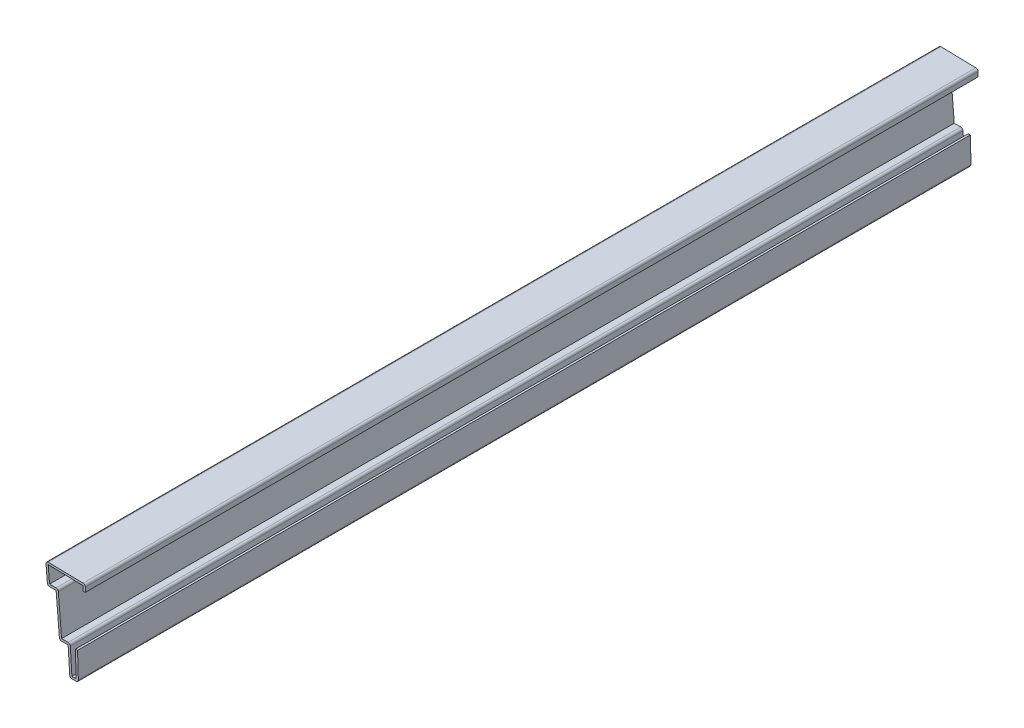
ISO-10303-21;
HEADER;
FILE_DESCRIPTION(('STEP AP214'),'2;1');
FILE_NAME('part.step','',(''),(''),'','','');
FILE_SCHEMA(('AUTOMOTIVE_DESIGN { 1 0 10303 214 1 1 1 1 }'));
ENDSEC;
DATA;
#1=APPLICATION_CONTEXT('core data for automotive mechanical design processes');
#2=APPLICATION_PROTOCOL_DEFINITION('international standard','automotive_design',2000,#1);
#3=PRODUCT_CONTEXT('',#1,'mechanical');
#4=PRODUCT('Part','Part','',(#3));
#5=PRODUCT_RELATED_PRODUCT_CATEGORY('part','',(#4));
#6=PRODUCT_DEFINITION_FORMATION('','',#4);
#7=PRODUCT_DEFINITION_CONTEXT('part definition',#1,'design');
#8=PRODUCT_DEFINITION('design','',#6,#7);
#9=PRODUCT_DEFINITION_SHAPE('','',#8);
#10=(LENGTH_UNIT() NAMED_UNIT(*) SI_UNIT(.MILLI.,.METRE.));
#11=(NAMED_UNIT(*) PLANE_ANGLE_UNIT() SI_UNIT($,.RADIAN.));
#12=(NAMED_UNIT(*) SI_UNIT($,.STERADIAN.) SOLID_ANGLE_UNIT());
#13=UNCERTAINTY_MEASURE_WITH_UNIT(LENGTH_MEASURE(1.E-05),#10,'distance_accuracy_value','');
#14=(GEOMETRIC_REPRESENTATION_CONTEXT(3) GLOBAL_UNCERTAINTY_ASSIGNED_CONTEXT((#13)) GLOBAL_UNIT_ASSIGNED_CONTEXT((#10,
#11,#12)) REPRESENTATION_CONTEXT('',''));
#15=CARTESIAN_POINT('',(0.,0.,0.));
#16=DIRECTION('',(0.,0.,1.));
#17=DIRECTION('',(1.,0.,0.));
#18=AXIS2_PLACEMENT_3D('',#15,#16,#17);
#19=CARTESIAN_POINT('',(2.15899999999999,40.878125,-412.75));
#20=DIRECTION('',(-1.,0.,0.));
#21=DIRECTION('',(0.,-1.,0.));
#22=AXIS2_PLACEMENT_3D('',#19,#20,#21);
#23=PLANE('',#22);
#24=DIRECTION('',(0.,-1.,0.));
#25=VECTOR('',#24,1.);
#26=CARTESIAN_POINT('',(2.15899999999999,40.878125,0.));
#27=LINE('',#26,#25);
#28=CARTESIAN_POINT('',(2.15899999999999,39.883971909265,0.));
#29=VERTEX_POINT('',#28);
#30=CARTESIAN_POINT('',(2.159,37.703125,0.));
#31=VERTEX_POINT('',#30);
#32=EDGE_CURVE('E295',#29,#31,#27,.T.);
#33=ORIENTED_EDGE('',*,*,#32,.F.);
#34=DIRECTION('',(0.,0.,1.));
#35=VECTOR('',#34,1.);
#36=CARTESIAN_POINT('',(2.15899999999999,39.883971909265,-412.75));
#37=LINE('',#36,#35);
#38=CARTESIAN_POINT('',(2.15899999999999,39.883971909265,-412.75));
#39=VERTEX_POINT('',#38);
#40=EDGE_CURVE('E245',#39,#29,#37,.T.);
#41=ORIENTED_EDGE('',*,*,#40,.F.);
#42=DIRECTION('',(0.,-1.,0.));
#43=VECTOR('',#42,1.);
#44=CARTESIAN_POINT('',(2.15899999999999,40.878125,-412.75));
#45=LINE('',#44,#43);
#46=CARTESIAN_POINT('',(2.159,37.703125,-412.75));
#47=VERTEX_POINT('',#46);
#48=EDGE_CURVE('E227',#39,#47,#45,.T.);
#49=ORIENTED_EDGE('',*,*,#48,.T.);
#50=DIRECTION('',(0.,0.,1.));
#51=VECTOR('',#50,1.);
#52=CARTESIAN_POINT('',(2.159,37.703125,-412.75));
#53=LINE('',#52,#51);
#54=EDGE_CURVE('E235',#47,#31,#53,.T.);
#55=ORIENTED_EDGE('',*,*,#54,.T.);
#56=EDGE_LOOP('',(#33,#41,#49,#55));
#57=FACE_BOUND('',#56,.T.);
#58=ADVANCED_FACE('F35',(#57),#23,.T.);
#59=CARTESIAN_POINT('',(-15.1033317393358,40.2592399905549,-412.75));
#60=DIRECTION('',(-0.0217339954092155,-0.999763788823916,0.));
#61=DIRECTION('',(0.999763788823916,-0.0217339954092155,0.));
#62=AXIS2_PLACEMENT_3D('',#59,#60,#61);
#63=PLANE('',#62);
#64=DIRECTION('',(0.999763788823916,-0.0217339954092155,0.));
#65=VECTOR('',#64,1.);
#66=CARTESIAN_POINT('',(-15.1033317393358,40.2592399905549,0.));
#67=LINE('',#66,#65);
#68=CARTESIAN_POINT('',(-13.975037647172,40.2347118581166,0.));
#69=VERTEX_POINT('',#68);
#70=EDGE_CURVE('E246',#69,#29,#67,.T.);
#71=ORIENTED_EDGE('',*,*,#70,.F.);
#72=DIRECTION('',(0.,0.,1.));
#73=VECTOR('',#72,1.);
#74=CARTESIAN_POINT('',(-13.975037647172,40.2347118581166,-412.75));
#75=LINE('',#74,#73);
#76=CARTESIAN_POINT('',(-13.975037647172,40.2347118581166,-412.75));
#77=VERTEX_POINT('',#76);
#78=EDGE_CURVE('E343',#77,#69,#75,.T.);
#79=ORIENTED_EDGE('',*,*,#78,.F.);
#80=DIRECTION('',(0.999763788823916,-0.0217339954092155,0.));
#81=VECTOR('',#80,1.);
#82=CARTESIAN_POINT('',(-15.1033317393358,40.2592399905549,-412.75));
#83=LINE('',#82,#81);
#84=EDGE_CURVE('E243',#77,#39,#83,.T.);
#85=ORIENTED_EDGE('',*,*,#84,.T.);
#86=ORIENTED_EDGE('',*,*,#40,.T.);
#87=EDGE_LOOP('',(#71,#79,#85,#86));
#88=FACE_BOUND('',#87,.T.);
#89=ADVANCED_FACE('F447',(#88),#63,.T.);
#90=CARTESIAN_POINT('',(-13.2750095096232,31.8343742075314,-412.75));
#91=DIRECTION('',(0.99654575824488,0.0830454798537397,0.));
#92=DIRECTION('',(-0.0830454798537397,0.99654575824488,0.));
#93=AXIS2_PLACEMENT_3D('',#90,#91,#92);
#94=PLANE('',#93);
#95=DIRECTION('',(-0.0830454798537397,0.99654575824488,0.));
#96=VECTOR('',#95,1.);
#97=CARTESIAN_POINT('',(-13.2750095096232,31.8343742075314,0.));
#98=LINE('',#97,#96);
#99=CARTESIAN_POINT('',(-13.3526449923289,32.766,0.));
#100=VERTEX_POINT('',#99);
#101=EDGE_CURVE('E249',#100,#69,#98,.T.);
#102=ORIENTED_EDGE('',*,*,#101,.F.);
#103=DIRECTION('',(0.,0.,1.));
#104=VECTOR('',#103,1.);
#105=CARTESIAN_POINT('',(-13.3526449923289,32.766,-412.75));
#106=LINE('',#105,#104);
#107=CARTESIAN_POINT('',(-13.3526449923289,32.766,-412.75));
#108=VERTEX_POINT('',#107);
#109=EDGE_CURVE('E345',#108,#100,#106,.T.);
#110=ORIENTED_EDGE('',*,*,#109,.F.);
#111=DIRECTION('',(-0.0830454798537397,0.99654575824488,0.));
#112=VECTOR('',#111,1.);
#113=CARTESIAN_POINT('',(-13.2750095096232,31.8343742075314,-412.75));
#114=LINE('',#113,#112);
#115=EDGE_CURVE('E291',#108,#77,#114,.T.);
#116=ORIENTED_EDGE('',*,*,#115,.T.);
#117=ORIENTED_EDGE('',*,*,#78,.T.);
#118=EDGE_LOOP('',(#102,#110,#116,#117));
#119=FACE_BOUND('',#118,.T.);
#120=ADVANCED_FACE('F453',(#119),#94,.T.);
#121=CARTESIAN_POINT('',(-10.31875,32.766,-412.75));
#122=DIRECTION('',(0.,1.,0.));
#123=DIRECTION('',(0.,0.,1.));
#124=AXIS2_PLACEMENT_3D('',#121,#122,#123);
#125=PLANE('',#124);
#126=DIRECTION('',(1.,0.,0.));
#127=VECTOR('',#126,1.);
#128=CARTESIAN_POINT('',(-10.31875,32.766,0.));
#129=LINE('',#128,#127);
#130=CARTESIAN_POINT('',(-10.31875,32.766,0.));
#131=VERTEX_POINT('',#130);
#132=EDGE_CURVE('E337',#131,#100,#129,.F.);
#133=ORIENTED_EDGE('',*,*,#132,.F.);
#134=DIRECTION('',(0.,0.,1.));
#135=VECTOR('',#134,1.);
#136=CARTESIAN_POINT('',(-10.31875,32.766,-412.75));
#137=LINE('',#136,#135);
#138=CARTESIAN_POINT('',(-10.31875,32.766,-412.75));
#139=VERTEX_POINT('',#138);
#140=EDGE_CURVE('E420',#131,#139,#137,.F.);
#141=ORIENTED_EDGE('',*,*,#140,.T.);
#142=DIRECTION('',(1.,0.,0.));
#143=VECTOR('',#142,1.);
#144=CARTESIAN_POINT('',(-10.31875,32.766,-412.75));
#145=LINE('',#144,#143);
#146=EDGE_CURVE('E289',#139,#108,#145,.F.);
#147=ORIENTED_EDGE('',*,*,#146,.T.);
#148=ORIENTED_EDGE('',*,*,#109,.T.);
#149=EDGE_LOOP('',(#133,#141,#147,#148));
#150=FACE_BOUND('',#149,.T.);
#151=ADVANCED_FACE('F456',(#150),#125,.T.);
#152=CARTESIAN_POINT('',(-7.71875950962321,12.7843742075314,-412.75));
#153=DIRECTION('',(0.99654575824488,0.0830454798537402,0.));
#154=DIRECTION('',(-0.0830454798537402,0.99654575824488,0.));
#155=AXIS2_PLACEMENT_3D('',#152,#153,#154);
#156=PLANE('',#155);
#157=DIRECTION('',(-0.0830454798537402,0.99654575824488,0.));
#158=VECTOR('',#157,1.);
#159=CARTESIAN_POINT('',(-7.71875950962321,12.7843742075314,-412.75));
#160=LINE('',#159,#158);
#161=CARTESIAN_POINT('',(-7.79639499232892,13.716,-412.75));
#162=VERTEX_POINT('',#161);
#163=CARTESIAN_POINT('',(-9.30625950962321,31.8343742075314,-412.75));
#164=VERTEX_POINT('',#163);
#165=EDGE_CURVE('E286',#162,#164,#160,.T.);
#166=ORIENTED_EDGE('',*,*,#165,.T.);
#167=DIRECTION('',(0.,0.,1.));
#168=VECTOR('',#167,1.);
#169=CARTESIAN_POINT('',(-9.30625950962321,31.8343742075314,-412.75));
#170=LINE('',#169,#168);
#171=CARTESIAN_POINT('',(-9.30625950962321,31.8343742075314,0.));
#172=VERTEX_POINT('',#171);
#173=EDGE_CURVE('E417',#164,#172,#170,.T.);
#174=ORIENTED_EDGE('',*,*,#173,.T.);
#175=DIRECTION('',(-0.0830454798537402,0.99654575824488,0.));
#176=VECTOR('',#175,1.);
#177=CARTESIAN_POINT('',(-7.71875950962321,12.7843742075314,0.));
#178=LINE('',#177,#176);
#179=CARTESIAN_POINT('',(-7.79639499232892,13.716,0.));
#180=VERTEX_POINT('',#179);
#181=EDGE_CURVE('E334',#180,#172,#178,.T.);
#182=ORIENTED_EDGE('',*,*,#181,.F.);
#183=DIRECTION('',(0.,0.,1.));
#184=VECTOR('',#183,1.);
#185=CARTESIAN_POINT('',(-7.79639499232892,13.716,-412.75));
#186=LINE('',#185,#184);
#187=EDGE_CURVE('E348',#162,#180,#186,.T.);
#188=ORIENTED_EDGE('',*,*,#187,.F.);
#189=EDGE_LOOP('',(#166,#174,#182,#188));
#190=FACE_BOUND('',#189,.T.);
#191=ADVANCED_FACE('F465',(#190),#156,.T.);
#192=CARTESIAN_POINT('',(-4.7625,13.716,-412.75));
#193=DIRECTION('',(0.,1.,0.));
#194=DIRECTION('',(0.,0.,1.));
#195=AXIS2_PLACEMENT_3D('',#192,#193,#194);
#196=PLANE('',#195);
#197=DIRECTION('',(1.,0.,0.));
#198=VECTOR('',#197,1.);
#199=CARTESIAN_POINT('',(-4.7625,13.716,0.));
#200=LINE('',#199,#198);
#201=CARTESIAN_POINT('',(-4.7625,13.716,0.));
#202=VERTEX_POINT('',#201);
#203=EDGE_CURVE('E332',#202,#180,#200,.F.);
#204=ORIENTED_EDGE('',*,*,#203,.F.);
#205=DIRECTION('',(0.,0.,1.));
#206=VECTOR('',#205,1.);
#207=CARTESIAN_POINT('',(-4.7625,13.716,-412.75));
#208=LINE('',#207,#206);
#209=CARTESIAN_POINT('',(-4.7625,13.716,-412.75));
#210=VERTEX_POINT('',#209);
#211=EDGE_CURVE('E410',#202,#210,#208,.F.);
#212=ORIENTED_EDGE('',*,*,#211,.T.);
#213=DIRECTION('',(1.,0.,0.));
#214=VECTOR('',#213,1.);
#215=CARTESIAN_POINT('',(-4.7625,13.716,-412.75));
#216=LINE('',#215,#214);
#217=EDGE_CURVE('E284',#210,#162,#216,.F.);
#218=ORIENTED_EDGE('',*,*,#217,.T.);
#219=ORIENTED_EDGE('',*,*,#187,.T.);
#220=EDGE_LOOP('',(#204,#212,#218,#219));
#221=FACE_BOUND('',#220,.T.);
#222=ADVANCED_FACE('F469',(#221),#196,.T.);
#223=CARTESIAN_POINT('',(-2.95472858026138,0.0633763387336631,-412.75));
#224=DIRECTION('',(0.998052578482889,0.0623782861551807,0.));
#225=DIRECTION('',(-0.0623782861551807,0.998052578482889,0.));
#226=AXIS2_PLACEMENT_3D('',#223,#224,#225);
#227=PLANE('',#226);
#228=DIRECTION('',(-0.0623782861551807,0.998052578482889,0.));
#229=VECTOR('',#228,1.);
#230=CARTESIAN_POINT('',(-2.95472858026138,0.0633763387336631,-412.75));
#231=LINE('',#230,#229);
#232=CARTESIAN_POINT('',(-3.01426755909053,1.016,-412.75));
#233=VERTEX_POINT('',#232);
#234=CARTESIAN_POINT('',(-3.74847858026139,12.7633763387337,-412.75));
#235=VERTEX_POINT('',#234);
#236=EDGE_CURVE('E281',#233,#235,#231,.T.);
#237=ORIENTED_EDGE('',*,*,#236,.T.);
#238=DIRECTION('',(0.,0.,1.));
#239=VECTOR('',#238,1.);
#240=CARTESIAN_POINT('',(-3.74847858026139,12.7633763387337,-412.75));
#241=LINE('',#240,#239);
#242=CARTESIAN_POINT('',(-3.74847858026139,12.7633763387337,0.));
#243=VERTEX_POINT('',#242);
#244=EDGE_CURVE('E407',#235,#243,#241,.T.);
#245=ORIENTED_EDGE('',*,*,#244,.T.);
#246=DIRECTION('',(-0.0623782861551807,0.998052578482889,0.));
#247=VECTOR('',#246,1.);
#248=CARTESIAN_POINT('',(-2.95472858026138,0.0633763387336631,0.));
#249=LINE('',#248,#247);
#250=CARTESIAN_POINT('',(-3.01426755909053,1.016,0.));
#251=VERTEX_POINT('',#250);
#252=EDGE_CURVE('E329',#251,#243,#249,.T.);
#253=ORIENTED_EDGE('',*,*,#252,.F.);
#254=DIRECTION('',(0.,0.,1.));
#255=VECTOR('',#254,1.);
#256=CARTESIAN_POINT('',(-3.01426755909053,1.016,-412.75));
#257=LINE('',#256,#255);
#258=EDGE_CURVE('E351',#233,#251,#257,.T.);
#259=ORIENTED_EDGE('',*,*,#258,.F.);
#260=EDGE_LOOP('',(#237,#245,#253,#259));
#261=FACE_BOUND('',#260,.T.);
#262=ADVANCED_FACE('F478',(#261),#227,.T.);
#263=CARTESIAN_POINT('',(0.,1.016,-412.75));
#264=DIRECTION('',(0.,1.,0.));
#265=DIRECTION('',(-1.,0.,0.));
#266=AXIS2_PLACEMENT_3D('',#263,#264,#265);
#267=PLANE('',#266);
#268=DIRECTION('',(-1.,0.,0.));
#269=VECTOR('',#268,1.);
#270=CARTESIAN_POINT('',(0.,1.016,0.));
#271=LINE('',#270,#269);
#272=CARTESIAN_POINT('',(-1.04824597269246,1.016,0.));
#273=VERTEX_POINT('',#272);
#274=EDGE_CURVE('E326',#273,#251,#271,.T.);
#275=ORIENTED_EDGE('',*,*,#274,.F.);
#276=DIRECTION('',(0.,0.,1.));
#277=VECTOR('',#276,1.);
#278=CARTESIAN_POINT('',(-1.04824597269246,1.016,-412.75));
#279=LINE('',#278,#277);
#280=CARTESIAN_POINT('',(-1.04824597269246,1.016,-412.75));
#281=VERTEX_POINT('',#280);
#282=EDGE_CURVE('E353',#281,#273,#279,.T.);
#283=ORIENTED_EDGE('',*,*,#282,.F.);
#284=DIRECTION('',(-1.,0.,0.));
#285=VECTOR('',#284,1.);
#286=CARTESIAN_POINT('',(0.,1.016,-412.75));
#287=LINE('',#286,#285);
#288=EDGE_CURVE('E278',#281,#233,#287,.T.);
#289=ORIENTED_EDGE('',*,*,#288,.T.);
#290=ORIENTED_EDGE('',*,*,#258,.T.);
#291=EDGE_LOOP('',(#275,#283,#289,#290));
#292=FACE_BOUND('',#291,.T.);
#293=ADVANCED_FACE('F483',(#292),#267,.T.);
#294=CARTESIAN_POINT('',(-1.01550426930447,-0.0317345084157649,-412.75));
#295=DIRECTION('',(-0.999512076087079,-0.0312347523777213,0.));
#296=DIRECTION('',(0.0312347523777213,-0.999512076087079,0.));
#297=AXIS2_PLACEMENT_3D('',#294,#295,#296);
#298=PLANE('',#297);
#299=DIRECTION('',(0.0312347523777213,-0.999512076087079,0.));
#300=VECTOR('',#299,1.);
#301=CARTESIAN_POINT('',(-1.01550426930447,-0.0317345084157649,0.));
#302=LINE('',#301,#300);
#303=CARTESIAN_POINT('',(-1.41237926930447,12.6682654915842,0.));
#304=VERTEX_POINT('',#303);
#305=EDGE_CURVE('E323',#304,#273,#302,.T.);
#306=ORIENTED_EDGE('',*,*,#305,.F.);
#307=DIRECTION('',(0.,0.,1.));
#308=VECTOR('',#307,1.);
#309=CARTESIAN_POINT('',(-1.41237926930447,12.6682654915842,-412.75));
#310=LINE('',#309,#308);
#311=CARTESIAN_POINT('',(-1.41237926930447,12.6682654915842,-412.75));
#312=VERTEX_POINT('',#311);
#313=EDGE_CURVE('E355',#312,#304,#310,.T.);
#314=ORIENTED_EDGE('',*,*,#313,.F.);
#315=DIRECTION('',(0.0312347523777213,-0.999512076087079,0.));
#316=VECTOR('',#315,1.);
#317=CARTESIAN_POINT('',(-1.01550426930447,-0.0317345084157649,-412.75));
#318=LINE('',#317,#316);
#319=EDGE_CURVE('E275',#312,#281,#318,.T.);
#320=ORIENTED_EDGE('',*,*,#319,.T.);
#321=ORIENTED_EDGE('',*,*,#282,.T.);
#322=EDGE_LOOP('',(#306,#314,#320,#321));
#323=FACE_BOUND('',#322,.T.);
#324=ADVANCED_FACE('F487',(#323),#298,.T.);
#325=CARTESIAN_POINT('',(-1.41237926930447,12.6682654915842,-412.75));
#326=DIRECTION('',(0.0312347523777177,-0.999512076087079,0.));
#327=DIRECTION('',(0.999512076087079,0.0312347523777177,0.));
#328=AXIS2_PLACEMENT_3D('',#325,#326,#327);
#329=PLANE('',#328);
#330=DIRECTION('',(0.999512076087079,0.0312347523777177,0.));
#331=VECTOR('',#330,1.);
#332=CARTESIAN_POINT('',(-1.41237926930447,12.6682654915842,0.));
#333=LINE('',#332,#331);
#334=CARTESIAN_POINT('',(-0.396875000000001,12.7,0.));
#335=VERTEX_POINT('',#334);
#336=EDGE_CURVE('E321',#304,#335,#333,.T.);
#337=ORIENTED_EDGE('',*,*,#336,.T.);
#338=DIRECTION('',(0.,0.,1.));
#339=VECTOR('',#338,1.);
#340=CARTESIAN_POINT('',(-0.396875000000001,12.7,-412.75));
#341=LINE('',#340,#339);
#342=CARTESIAN_POINT('',(-0.396875000000001,12.7,-412.75));
#343=VERTEX_POINT('',#342);
#344=EDGE_CURVE('E357',#343,#335,#341,.T.);
#345=ORIENTED_EDGE('',*,*,#344,.F.);
#346=DIRECTION('',(0.999512076087079,0.0312347523777177,0.));
#347=VECTOR('',#346,1.);
#348=CARTESIAN_POINT('',(-1.41237926930447,12.6682654915842,-412.75));
#349=LINE('',#348,#347);
#350=EDGE_CURVE('E273',#312,#343,#349,.T.);
#351=ORIENTED_EDGE('',*,*,#350,.F.);
#352=ORIENTED_EDGE('',*,*,#313,.T.);
#353=EDGE_LOOP('',(#337,#345,#351,#352));
#354=FACE_BOUND('',#353,.T.);
#355=ADVANCED_FACE('F491',(#354),#329,.F.);
#356=CARTESIAN_POINT('',(0.,0.,-412.75));
#357=DIRECTION('',(-0.999512076087079,-0.0312347523777213,0.));
#358=DIRECTION('',(0.0312347523777213,-0.999512076087079,0.));
#359=AXIS2_PLACEMENT_3D('',#356,#357,#358);
#360=PLANE('',#359);
#361=DIRECTION('',(0.0312347523777213,-0.999512076087079,0.));
#362=VECTOR('',#361,1.);
#363=CARTESIAN_POINT('',(0.,0.,0.));
#364=LINE('',#363,#362);
#365=CARTESIAN_POINT('',(-0.0327417033879928,1.04773450841576,0.));
#366=VERTEX_POINT('',#365);
#367=EDGE_CURVE('E318',#335,#366,#364,.T.);
#368=ORIENTED_EDGE('',*,*,#367,.T.);
#369=DIRECTION('',(0.,0.,1.));
#370=VECTOR('',#369,1.);
#371=CARTESIAN_POINT('',(-0.0327417033879928,1.04773450841576,-412.75));
#372=LINE('',#371,#370);
#373=CARTESIAN_POINT('',(-0.0327417033879928,1.04773450841576,-412.75));
#374=VERTEX_POINT('',#373);
#375=EDGE_CURVE('E387',#366,#374,#372,.F.);
#376=ORIENTED_EDGE('',*,*,#375,.T.);
#377=DIRECTION('',(0.0312347523777213,-0.999512076087079,0.));
#378=VECTOR('',#377,1.);
#379=CARTESIAN_POINT('',(0.,0.,-412.75));
#380=LINE('',#379,#378);
#381=EDGE_CURVE('E271',#343,#374,#380,.T.);
#382=ORIENTED_EDGE('',*,*,#381,.F.);
#383=ORIENTED_EDGE('',*,*,#344,.T.);
#384=EDGE_LOOP('',(#368,#376,#382,#383));
#385=FACE_BOUND('',#384,.T.);
#386=ADVANCED_FACE('F685',(#385),#360,.F.);
#387=CARTESIAN_POINT('',(0.,0.,-412.75));
#388=DIRECTION('',(0.,1.,0.));
#389=DIRECTION('',(-1.,0.,0.));
#390=AXIS2_PLACEMENT_3D('',#387,#388,#389);
#391=PLANE('',#390);
#392=DIRECTION('',(-1.,0.,0.));
#393=VECTOR('',#392,1.);
#394=CARTESIAN_POINT('',(0.,0.,-412.75));
#395=LINE('',#394,#393);
#396=CARTESIAN_POINT('',(-1.04824597269246,0.,-412.75));
#397=VERTEX_POINT('',#396);
#398=CARTESIAN_POINT('',(-3.01426755909053,0.,-412.75));
#399=VERTEX_POINT('',#398);
#400=EDGE_CURVE('E268',#397,#399,#395,.T.);
#401=ORIENTED_EDGE('',*,*,#400,.F.);
#402=DIRECTION('',(0.,0.,1.));
#403=VECTOR('',#402,1.);
#404=CARTESIAN_POINT('',(-1.04824597269246,0.,-412.75));
#405=LINE('',#404,#403);
#406=CARTESIAN_POINT('',(-1.04824597269246,0.,0.));
#407=VERTEX_POINT('',#406);
#408=EDGE_CURVE('E368',#397,#407,#405,.T.);
#409=ORIENTED_EDGE('',*,*,#408,.T.);
#410=DIRECTION('',(-1.,0.,0.));
#411=VECTOR('',#410,1.);
#412=CARTESIAN_POINT('',(0.,0.,0.));
#413=LINE('',#412,#411);
#414=CARTESIAN_POINT('',(-3.01426755909053,0.,0.));
#415=VERTEX_POINT('',#414);
#416=EDGE_CURVE('E315',#407,#415,#413,.T.);
#417=ORIENTED_EDGE('',*,*,#416,.T.);
#418=DIRECTION('',(0.,0.,1.));
#419=VECTOR('',#418,1.);
#420=CARTESIAN_POINT('',(-3.01426755909053,0.,-412.75));
#421=LINE('',#420,#419);
#422=EDGE_CURVE('E342',#415,#399,#421,.F.);
#423=ORIENTED_EDGE('',*,*,#422,.T.);
#424=EDGE_LOOP('',(#401,#409,#417,#423));
#425=FACE_BOUND('',#424,.T.);
#426=ADVANCED_FACE('F501',(#425),#391,.F.);
#427=CARTESIAN_POINT('',(-3.96875,0.,-412.75));
#428=DIRECTION('',(0.998052578482889,0.0623782861551807,0.));
#429=DIRECTION('',(-0.0623782861551807,0.998052578482889,0.));
#430=AXIS2_PLACEMENT_3D('',#427,#428,#429);
#431=PLANE('',#430);
#432=DIRECTION('',(-0.0623782861551807,0.998052578482889,0.));
#433=VECTOR('',#432,1.);
#434=CARTESIAN_POINT('',(-3.96875,0.,-412.75));
#435=LINE('',#434,#433);
#436=CARTESIAN_POINT('',(-4.02828897882915,0.952623661266336,-412.75));
#437=VERTEX_POINT('',#436);
#438=CARTESIAN_POINT('',(-4.7625,12.7,-412.75));
#439=VERTEX_POINT('',#438);
#440=EDGE_CURVE('E266',#437,#439,#435,.T.);
#441=ORIENTED_EDGE('',*,*,#440,.F.);
#442=DIRECTION('',(0.,0.,1.));
#443=VECTOR('',#442,1.);
#444=CARTESIAN_POINT('',(-4.02828897882915,0.952623661266336,-412.75));
#445=LINE('',#444,#443);
#446=CARTESIAN_POINT('',(-4.02828897882915,0.952623661266336,0.));
#447=VERTEX_POINT('',#446);
#448=EDGE_CURVE('E404',#437,#447,#445,.T.);
#449=ORIENTED_EDGE('',*,*,#448,.T.);
#450=DIRECTION('',(-0.0623782861551807,0.998052578482889,0.));
#451=VECTOR('',#450,1.);
#452=CARTESIAN_POINT('',(-3.96875,0.,0.));
#453=LINE('',#452,#451);
#454=CARTESIAN_POINT('',(-4.7625,12.7,0.));
#455=VERTEX_POINT('',#454);
#456=EDGE_CURVE('E313',#447,#455,#453,.T.);
#457=ORIENTED_EDGE('',*,*,#456,.T.);
#458=DIRECTION('',(0.,0.,1.));
#459=VECTOR('',#458,1.);
#460=CARTESIAN_POINT('',(-4.7625,12.7,-412.75));
#461=LINE('',#460,#459);
#462=EDGE_CURVE('E360',#439,#455,#461,.T.);
#463=ORIENTED_EDGE('',*,*,#462,.F.);
#464=EDGE_LOOP('',(#441,#449,#457,#463));
#465=FACE_BOUND('',#464,.T.);
#466=ADVANCED_FACE('F512',(#465),#431,.F.);
#467=CARTESIAN_POINT('',(-4.7625,12.7,-412.75));
#468=DIRECTION('',(0.,1.,0.));
#469=DIRECTION('',(0.,0.,1.));
#470=AXIS2_PLACEMENT_3D('',#467,#468,#469);
#471=PLANE('',#470);
#472=DIRECTION('',(-1.,0.,0.));
#473=VECTOR('',#472,1.);
#474=CARTESIAN_POINT('',(-4.7625,12.7,0.));
#475=LINE('',#474,#473);
#476=CARTESIAN_POINT('',(-7.79639499232892,12.7,0.));
#477=VERTEX_POINT('',#476);
#478=EDGE_CURVE('E310',#455,#477,#475,.T.);
#479=ORIENTED_EDGE('',*,*,#478,.T.);
#480=DIRECTION('',(0.,0.,1.));
#481=VECTOR('',#480,1.);
#482=CARTESIAN_POINT('',(-7.79639499232892,12.7,-412.75));
#483=LINE('',#482,#481);
#484=CARTESIAN_POINT('',(-7.79639499232892,12.7,-412.75));
#485=VERTEX_POINT('',#484);
#486=EDGE_CURVE('E415',#477,#485,#483,.F.);
#487=ORIENTED_EDGE('',*,*,#486,.T.);
#488=DIRECTION('',(-1.,0.,0.));
#489=VECTOR('',#488,1.);
#490=CARTESIAN_POINT('',(-4.7625,12.7,-412.75));
#491=LINE('',#490,#489);
#492=EDGE_CURVE('E263',#439,#485,#491,.T.);
#493=ORIENTED_EDGE('',*,*,#492,.F.);
#494=ORIENTED_EDGE('',*,*,#462,.T.);
#495=EDGE_LOOP('',(#479,#487,#493,#494));
#496=FACE_BOUND('',#495,.T.);
#497=ADVANCED_FACE('F663',(#496),#471,.F.);
#498=CARTESIAN_POINT('',(-8.73125,12.7,-412.75));
#499=DIRECTION('',(0.99654575824488,0.0830454798537402,0.));
#500=DIRECTION('',(-0.0830454798537402,0.99654575824488,0.));
#501=AXIS2_PLACEMENT_3D('',#498,#499,#500);
#502=PLANE('',#501);
#503=DIRECTION('',(-0.0830454798537402,0.99654575824488,0.));
#504=VECTOR('',#503,1.);
#505=CARTESIAN_POINT('',(-8.73125,12.7,-412.75));
#506=LINE('',#505,#504);
#507=CARTESIAN_POINT('',(-8.80888548270572,13.6316257924686,-412.75));
#508=VERTEX_POINT('',#507);
#509=CARTESIAN_POINT('',(-10.31875,31.75,-412.75));
#510=VERTEX_POINT('',#509);
#511=EDGE_CURVE('E261',#508,#510,#506,.T.);
#512=ORIENTED_EDGE('',*,*,#511,.F.);
#513=DIRECTION('',(0.,0.,1.));
#514=VECTOR('',#513,1.);
#515=CARTESIAN_POINT('',(-8.80888548270572,13.6316257924686,-412.75));
#516=LINE('',#515,#514);
#517=CARTESIAN_POINT('',(-8.80888548270572,13.6316257924686,0.));
#518=VERTEX_POINT('',#517);
#519=EDGE_CURVE('E412',#508,#518,#516,.T.);
#520=ORIENTED_EDGE('',*,*,#519,.T.);
#521=DIRECTION('',(-0.0830454798537402,0.99654575824488,0.));
#522=VECTOR('',#521,1.);
#523=CARTESIAN_POINT('',(-8.73125,12.7,0.));
#524=LINE('',#523,#522);
#525=CARTESIAN_POINT('',(-10.31875,31.75,0.));
#526=VERTEX_POINT('',#525);
#527=EDGE_CURVE('E308',#518,#526,#524,.T.);
#528=ORIENTED_EDGE('',*,*,#527,.T.);
#529=DIRECTION('',(0.,0.,1.));
#530=VECTOR('',#529,1.);
#531=CARTESIAN_POINT('',(-10.31875,31.75,-412.75));
#532=LINE('',#531,#530);
#533=EDGE_CURVE('E363',#510,#526,#532,.T.);
#534=ORIENTED_EDGE('',*,*,#533,.F.);
#535=EDGE_LOOP('',(#512,#520,#528,#534));
#536=FACE_BOUND('',#535,.T.);
#537=ADVANCED_FACE('F524',(#536),#502,.F.);
#538=CARTESIAN_POINT('',(-10.31875,31.75,-412.75));
#539=DIRECTION('',(0.,1.,0.));
#540=DIRECTION('',(0.,0.,1.));
#541=AXIS2_PLACEMENT_3D('',#538,#539,#540);
#542=PLANE('',#541);
#543=DIRECTION('',(-1.,0.,0.));
#544=VECTOR('',#543,1.);
#545=CARTESIAN_POINT('',(-10.31875,31.75,0.));
#546=LINE('',#545,#544);
#547=CARTESIAN_POINT('',(-13.3526449923289,31.75,0.));
#548=VERTEX_POINT('',#547);
#549=EDGE_CURVE('E305',#526,#548,#546,.T.);
#550=ORIENTED_EDGE('',*,*,#549,.T.);
#551=DIRECTION('',(0.,0.,1.));
#552=VECTOR('',#551,1.);
#553=CARTESIAN_POINT('',(-13.3526449923289,31.75,-412.75));
#554=LINE('',#553,#552);
#555=CARTESIAN_POINT('',(-13.3526449923289,31.75,-412.75));
#556=VERTEX_POINT('',#555);
#557=EDGE_CURVE('E427',#548,#556,#554,.F.);
#558=ORIENTED_EDGE('',*,*,#557,.T.);
#559=DIRECTION('',(-1.,0.,0.));
#560=VECTOR('',#559,1.);
#561=CARTESIAN_POINT('',(-10.31875,31.75,-412.75));
#562=LINE('',#561,#560);
#563=EDGE_CURVE('E258',#510,#556,#562,.T.);
#564=ORIENTED_EDGE('',*,*,#563,.F.);
#565=ORIENTED_EDGE('',*,*,#533,.T.);
#566=EDGE_LOOP('',(#550,#558,#564,#565));
#567=FACE_BOUND('',#566,.T.);
#568=ADVANCED_FACE('F529',(#567),#542,.F.);
#569=CARTESIAN_POINT('',(-14.2875,31.75,-412.75));
#570=DIRECTION('',(0.99654575824488,0.0830454798537397,0.));
#571=DIRECTION('',(-0.0830454798537397,0.99654575824488,0.));
#572=AXIS2_PLACEMENT_3D('',#569,#570,#571);
#573=PLANE('',#572);
#574=DIRECTION('',(-0.0830454798537397,0.99654575824488,0.));
#575=VECTOR('',#574,1.);
#576=CARTESIAN_POINT('',(-14.2875,31.75,-412.75));
#577=LINE('',#576,#575);
#578=CARTESIAN_POINT('',(-14.3651354827057,32.6816257924686,-412.75));
#579=VERTEX_POINT('',#578);
#580=CARTESIAN_POINT('',(-14.9875281375488,40.1503376505852,-412.75));
#581=VERTEX_POINT('',#580);
#582=EDGE_CURVE('E255',#579,#581,#577,.T.);
#583=ORIENTED_EDGE('',*,*,#582,.F.);
#584=DIRECTION('',(0.,0.,1.));
#585=VECTOR('',#584,1.);
#586=CARTESIAN_POINT('',(-14.3651354827057,32.6816257924686,-412.75));
#587=LINE('',#586,#585);
#588=CARTESIAN_POINT('',(-14.3651354827057,32.6816257924686,0.));
#589=VERTEX_POINT('',#588);
#590=EDGE_CURVE('E424',#579,#589,#587,.T.);
#591=ORIENTED_EDGE('',*,*,#590,.T.);
#592=DIRECTION('',(-0.0830454798537397,0.99654575824488,0.));
#593=VECTOR('',#592,1.);
#594=CARTESIAN_POINT('',(-14.2875,31.75,0.));
#595=LINE('',#594,#593);
#596=CARTESIAN_POINT('',(-14.9875281375488,40.1503376505852,0.));
#597=VERTEX_POINT('',#596);
#598=EDGE_CURVE('E302',#589,#597,#595,.T.);
#599=ORIENTED_EDGE('',*,*,#598,.T.);
#600=DIRECTION('',(0.,0.,1.));
#601=VECTOR('',#600,1.);
#602=CARTESIAN_POINT('',(-14.9875281375488,40.1503376505852,-412.75));
#603=LINE('',#602,#601);
#604=EDGE_CURVE('E422',#597,#581,#603,.F.);
#605=ORIENTED_EDGE('',*,*,#604,.T.);
#606=EDGE_LOOP('',(#583,#591,#599,#605));
#607=FACE_BOUND('',#606,.T.);
#608=ADVANCED_FACE('F537',(#607),#573,.F.);
#609=CARTESIAN_POINT('',(-15.08125,41.275,-412.75));
#610=DIRECTION('',(-0.0217339954092155,-0.999763788823916,0.));
#611=DIRECTION('',(0.999763788823916,-0.0217339954092155,0.));
#612=AXIS2_PLACEMENT_3D('',#609,#610,#611);
#613=PLANE('',#612);
#614=DIRECTION('',(0.999763788823916,-0.0217339954092155,0.));
#615=VECTOR('',#614,1.);
#616=CARTESIAN_POINT('',(-15.08125,41.275,-412.75));
#617=LINE('',#616,#615);
#618=CARTESIAN_POINT('',(-13.9529559078362,41.2504718675617,-412.75));
#619=VERTEX_POINT('',#618);
#620=CARTESIAN_POINT('',(2.18108173933576,40.8997319187101,-412.75));
#621=VERTEX_POINT('',#620);
#622=EDGE_CURVE('E253',#619,#621,#617,.T.);
#623=ORIENTED_EDGE('',*,*,#622,.F.);
#624=DIRECTION('',(0.,0.,1.));
#625=VECTOR('',#624,1.);
#626=CARTESIAN_POINT('',(-13.9529559078362,41.2504718675617,-412.75));
#627=LINE('',#626,#625);
#628=CARTESIAN_POINT('',(-13.9529559078362,41.2504718675617,0.));
#629=VERTEX_POINT('',#628);
#630=EDGE_CURVE('E43',#619,#629,#627,.T.);
#631=ORIENTED_EDGE('',*,*,#630,.T.);
#632=DIRECTION('',(0.999763788823916,-0.0217339954092155,0.));
#633=VECTOR('',#632,1.);
#634=CARTESIAN_POINT('',(-15.08125,41.275,0.));
#635=LINE('',#634,#633);
#636=CARTESIAN_POINT('',(2.18108173933576,40.8997319187101,0.));
#637=VERTEX_POINT('',#636);
#638=EDGE_CURVE('E300',#629,#637,#635,.T.);
#639=ORIENTED_EDGE('',*,*,#638,.T.);
#640=DIRECTION('',(0.,0.,1.));
#641=VECTOR('',#640,1.);
#642=CARTESIAN_POINT('',(2.18108173933576,40.8997319187101,-412.75));
#643=LINE('',#642,#641);
#644=EDGE_CURVE('E58',#637,#621,#643,.F.);
#645=ORIENTED_EDGE('',*,*,#644,.T.);
#646=EDGE_LOOP('',(#623,#631,#639,#645));
#647=FACE_BOUND('',#646,.T.);
#648=ADVANCED_FACE('F432',(#647),#613,.F.);
#649=CARTESIAN_POINT('',(3.17499999999999,40.878125,-412.75));
#650=DIRECTION('',(-1.,0.,0.));
#651=DIRECTION('',(0.,-1.,0.));
#652=AXIS2_PLACEMENT_3D('',#649,#650,#651);
#653=PLANE('',#652);
#654=DIRECTION('',(0.,-1.,0.));
#655=VECTOR('',#654,1.);
#656=CARTESIAN_POINT('',(3.17499999999999,40.878125,-412.75));
#657=LINE('',#656,#655);
#658=CARTESIAN_POINT('',(3.17499999999999,39.883971909265,-412.75));
#659=VERTEX_POINT('',#658);
#660=CARTESIAN_POINT('',(3.175,37.703125,-412.75));
#661=VERTEX_POINT('',#660);
#662=EDGE_CURVE('E229',#659,#661,#657,.T.);
#663=ORIENTED_EDGE('',*,*,#662,.F.);
#664=DIRECTION('',(0.,0.,1.));
#665=VECTOR('',#664,1.);
#666=CARTESIAN_POINT('',(3.17499999999999,39.883971909265,-412.75));
#667=LINE('',#666,#665);
#668=CARTESIAN_POINT('',(3.17499999999999,39.883971909265,0.));
#669=VERTEX_POINT('',#668);
#670=EDGE_CURVE('E11',#659,#669,#667,.T.);
#671=ORIENTED_EDGE('',*,*,#670,.T.);
#672=DIRECTION('',(0.,-1.,0.));
#673=VECTOR('',#672,1.);
#674=CARTESIAN_POINT('',(3.17499999999999,40.878125,0.));
#675=LINE('',#674,#673);
#676=CARTESIAN_POINT('',(3.175,37.703125,0.));
#677=VERTEX_POINT('',#676);
#678=EDGE_CURVE('E298',#669,#677,#675,.T.);
#679=ORIENTED_EDGE('',*,*,#678,.T.);
#680=DIRECTION('',(0.,0.,1.));
#681=VECTOR('',#680,1.);
#682=CARTESIAN_POINT('',(3.175,37.703125,-412.75));
#683=LINE('',#682,#681);
#684=EDGE_CURVE('E242',#661,#677,#683,.T.);
#685=ORIENTED_EDGE('',*,*,#684,.F.);
#686=EDGE_LOOP('',(#663,#671,#679,#685));
#687=FACE_BOUND('',#686,.T.);
#688=ADVANCED_FACE('F443',(#687),#653,.F.);
#689=CARTESIAN_POINT('',(3.175,37.703125,-412.75));
#690=DIRECTION('',(0.,1.,0.));
#691=DIRECTION('',(0.,0.,1.));
#692=AXIS2_PLACEMENT_3D('',#689,#690,#691);
#693=PLANE('',#692);
#694=DIRECTION('',(-1.,0.,0.));
#695=VECTOR('',#694,1.);
#696=CARTESIAN_POINT('',(3.175,37.703125,0.));
#697=LINE('',#696,#695);
#698=EDGE_CURVE('E238',#677,#31,#697,.T.);
#699=ORIENTED_EDGE('',*,*,#698,.T.);
#700=ORIENTED_EDGE('',*,*,#54,.F.);
#701=DIRECTION('',(-1.,0.,0.));
#702=VECTOR('',#701,1.);
#703=CARTESIAN_POINT('',(3.175,37.703125,-412.75));
#704=LINE('',#703,#702);
#705=EDGE_CURVE('E221',#661,#47,#704,.T.);
#706=ORIENTED_EDGE('',*,*,#705,.F.);
#707=ORIENTED_EDGE('',*,*,#684,.T.);
#708=EDGE_LOOP('',(#699,#700,#706,#707));
#709=FACE_BOUND('',#708,.T.);
#710=ADVANCED_FACE('F236',(#709),#693,.F.);
#711=CARTESIAN_POINT('',(0.,0.,-412.75));
#712=DIRECTION('',(0.,0.,-1.));
#713=DIRECTION('',(-1.,0.,0.));
#714=AXIS2_PLACEMENT_3D('',#711,#712,#713);
#715=PLANE('',#714);
#716=ORIENTED_EDGE('',*,*,#381,.T.);
#717=CARTESIAN_POINT('',(-1.04824597269246,1.016,-412.75));
#718=DIRECTION('',(0.,0.,-1.));
#719=DIRECTION('',(-1.,0.,0.));
#720=AXIS2_PLACEMENT_3D('',#717,#718,#719);
#721=CIRCLE('',#720,1.016);
#722=EDGE_CURVE('E402',#374,#397,#721,.T.);
#723=ORIENTED_EDGE('',*,*,#722,.T.);
#724=ORIENTED_EDGE('',*,*,#400,.T.);
#725=CARTESIAN_POINT('',(-3.01426755909053,1.016,-412.75));
#726=DIRECTION('',(0.,0.,-1.));
#727=DIRECTION('',(-1.,0.,0.));
#728=AXIS2_PLACEMENT_3D('',#725,#726,#727);
#729=CIRCLE('',#728,1.016);
#730=EDGE_CURVE('E400',#399,#437,#729,.T.);
#731=ORIENTED_EDGE('',*,*,#730,.T.);
#732=ORIENTED_EDGE('',*,*,#440,.T.);
#733=ORIENTED_EDGE('',*,*,#492,.T.);
#734=CARTESIAN_POINT('',(-7.79639499232892,13.716,-412.75));
#735=DIRECTION('',(0.,0.,-1.));
#736=DIRECTION('',(-1.,0.,0.));
#737=AXIS2_PLACEMENT_3D('',#734,#735,#736);
#738=CIRCLE('',#737,1.016);
#739=EDGE_CURVE('E396',#485,#508,#738,.T.);
#740=ORIENTED_EDGE('',*,*,#739,.T.);
#741=ORIENTED_EDGE('',*,*,#511,.T.);
#742=ORIENTED_EDGE('',*,*,#563,.T.);
#743=CARTESIAN_POINT('',(-13.3526449923289,32.766,-412.75));
#744=DIRECTION('',(0.,0.,-1.));
#745=DIRECTION('',(-1.,0.,0.));
#746=AXIS2_PLACEMENT_3D('',#743,#744,#745);
#747=CIRCLE('',#746,1.016);
#748=EDGE_CURVE('E392',#556,#579,#747,.T.);
#749=ORIENTED_EDGE('',*,*,#748,.T.);
#750=ORIENTED_EDGE('',*,*,#582,.T.);
#751=CARTESIAN_POINT('',(-13.975037647172,40.2347118581166,-412.75));
#752=DIRECTION('',(0.,0.,-1.));
#753=DIRECTION('',(-1.,0.,0.));
#754=AXIS2_PLACEMENT_3D('',#751,#752,#753);
#755=CIRCLE('',#754,1.016);
#756=EDGE_CURVE('E390',#581,#619,#755,.T.);
#757=ORIENTED_EDGE('',*,*,#756,.T.);
#758=ORIENTED_EDGE('',*,*,#622,.T.);
#759=CARTESIAN_POINT('',(2.15899999999999,39.883971909265,-412.75));
#760=DIRECTION('',(0.,0.,-1.));
#761=DIRECTION('',(-1.,0.,0.));
#762=AXIS2_PLACEMENT_3D('',#759,#760,#761);
#763=CIRCLE('',#762,1.016);
#764=EDGE_CURVE('E50',#621,#659,#763,.T.);
#765=ORIENTED_EDGE('',*,*,#764,.T.);
#766=ORIENTED_EDGE('',*,*,#662,.T.);
#767=ORIENTED_EDGE('',*,*,#705,.T.);
#768=ORIENTED_EDGE('',*,*,#48,.F.);
#769=ORIENTED_EDGE('',*,*,#84,.F.);
#770=ORIENTED_EDGE('',*,*,#115,.F.);
#771=ORIENTED_EDGE('',*,*,#146,.F.);
#772=CARTESIAN_POINT('',(-10.31875,31.75,-412.75));
#773=DIRECTION('',(0.,0.,-1.));
#774=DIRECTION('',(-1.,0.,0.));
#775=AXIS2_PLACEMENT_3D('',#772,#773,#774);
#776=CIRCLE('',#775,1.016);
#777=EDGE_CURVE('E394',#139,#164,#776,.T.);
#778=ORIENTED_EDGE('',*,*,#777,.T.);
#779=ORIENTED_EDGE('',*,*,#165,.F.);
#780=ORIENTED_EDGE('',*,*,#217,.F.);
#781=CARTESIAN_POINT('',(-4.7625,12.7,-412.75));
#782=DIRECTION('',(0.,0.,-1.));
#783=DIRECTION('',(-1.,0.,0.));
#784=AXIS2_PLACEMENT_3D('',#781,#782,#783);
#785=CIRCLE('',#784,1.016);
#786=EDGE_CURVE('E398',#210,#235,#785,.T.);
#787=ORIENTED_EDGE('',*,*,#786,.T.);
#788=ORIENTED_EDGE('',*,*,#236,.F.);
#789=ORIENTED_EDGE('',*,*,#288,.F.);
#790=ORIENTED_EDGE('',*,*,#319,.F.);
#791=ORIENTED_EDGE('',*,*,#350,.T.);
#792=EDGE_LOOP('',(#716,#723,#724,#731,#732,#733,#740,#741,#742,#749,#750,#757,#758,#765,#766,
#767,#768,#769,#770,#771,#778,#779,#780,#787,#788,#789,#790,#791));
#793=FACE_BOUND('',#792,.T.);
#794=ADVANCED_FACE('F224',(#793),#715,.T.);
#795=CARTESIAN_POINT('',(0.,0.,0.));
#796=DIRECTION('',(0.,0.,-1.));
#797=DIRECTION('',(-1.,0.,0.));
#798=AXIS2_PLACEMENT_3D('',#795,#796,#797);
#799=PLANE('',#798);
#800=ORIENTED_EDGE('',*,*,#416,.F.);
#801=CARTESIAN_POINT('',(-1.04824597269246,1.016,0.));
#802=DIRECTION('',(0.,0.,-1.));
#803=DIRECTION('',(-1.,0.,0.));
#804=AXIS2_PLACEMENT_3D('',#801,#802,#803);
#805=CIRCLE('',#804,1.016);
#806=EDGE_CURVE('E385',#407,#366,#805,.F.);
#807=ORIENTED_EDGE('',*,*,#806,.T.);
#808=ORIENTED_EDGE('',*,*,#367,.F.);
#809=ORIENTED_EDGE('',*,*,#336,.F.);
#810=ORIENTED_EDGE('',*,*,#305,.T.);
#811=ORIENTED_EDGE('',*,*,#274,.T.);
#812=ORIENTED_EDGE('',*,*,#252,.T.);
#813=CARTESIAN_POINT('',(-4.7625,12.7,0.));
#814=DIRECTION('',(0.,0.,-1.));
#815=DIRECTION('',(-1.,0.,0.));
#816=AXIS2_PLACEMENT_3D('',#813,#814,#815);
#817=CIRCLE('',#816,1.016);
#818=EDGE_CURVE('E381',#243,#202,#817,.F.);
#819=ORIENTED_EDGE('',*,*,#818,.T.);
#820=ORIENTED_EDGE('',*,*,#203,.T.);
#821=ORIENTED_EDGE('',*,*,#181,.T.);
#822=CARTESIAN_POINT('',(-10.31875,31.75,0.));
#823=DIRECTION('',(0.,0.,-1.));
#824=DIRECTION('',(-1.,0.,0.));
#825=AXIS2_PLACEMENT_3D('',#822,#823,#824);
#826=CIRCLE('',#825,1.016);
#827=EDGE_CURVE('E377',#172,#131,#826,.F.);
#828=ORIENTED_EDGE('',*,*,#827,.T.);
#829=ORIENTED_EDGE('',*,*,#132,.T.);
#830=ORIENTED_EDGE('',*,*,#101,.T.);
#831=ORIENTED_EDGE('',*,*,#70,.T.);
#832=ORIENTED_EDGE('',*,*,#32,.T.);
#833=ORIENTED_EDGE('',*,*,#698,.F.);
#834=ORIENTED_EDGE('',*,*,#678,.F.);
#835=CARTESIAN_POINT('',(2.15899999999999,39.883971909265,0.));
#836=DIRECTION('',(0.,0.,-1.));
#837=DIRECTION('',(-1.,0.,0.));
#838=AXIS2_PLACEMENT_3D('',#835,#836,#837);
#839=CIRCLE('',#838,1.016);
#840=EDGE_CURVE('E371',#669,#637,#839,.F.);
#841=ORIENTED_EDGE('',*,*,#840,.T.);
#842=ORIENTED_EDGE('',*,*,#638,.F.);
#843=CARTESIAN_POINT('',(-13.975037647172,40.2347118581166,0.));
#844=DIRECTION('',(0.,0.,-1.));
#845=DIRECTION('',(-1.,0.,0.));
#846=AXIS2_PLACEMENT_3D('',#843,#844,#845);
#847=CIRCLE('',#846,1.016);
#848=EDGE_CURVE('E373',#629,#597,#847,.F.);
#849=ORIENTED_EDGE('',*,*,#848,.T.);
#850=ORIENTED_EDGE('',*,*,#598,.F.);
#851=CARTESIAN_POINT('',(-13.3526449923289,32.766,0.));
#852=DIRECTION('',(0.,0.,-1.));
#853=DIRECTION('',(-1.,0.,0.));
#854=AXIS2_PLACEMENT_3D('',#851,#852,#853);
#855=CIRCLE('',#854,1.016);
#856=EDGE_CURVE('E375',#589,#548,#855,.F.);
#857=ORIENTED_EDGE('',*,*,#856,.T.);
#858=ORIENTED_EDGE('',*,*,#549,.F.);
#859=ORIENTED_EDGE('',*,*,#527,.F.);
#860=CARTESIAN_POINT('',(-7.79639499232892,13.716,0.));
#861=DIRECTION('',(0.,0.,-1.));
#862=DIRECTION('',(-1.,0.,0.));
#863=AXIS2_PLACEMENT_3D('',#860,#861,#862);
#864=CIRCLE('',#863,1.016);
#865=EDGE_CURVE('E379',#518,#477,#864,.F.);
#866=ORIENTED_EDGE('',*,*,#865,.T.);
#867=ORIENTED_EDGE('',*,*,#478,.F.);
#868=ORIENTED_EDGE('',*,*,#456,.F.);
#869=CARTESIAN_POINT('',(-3.01426755909053,1.016,0.));
#870=DIRECTION('',(0.,0.,-1.));
#871=DIRECTION('',(-1.,0.,0.));
#872=AXIS2_PLACEMENT_3D('',#869,#870,#871);
#873=CIRCLE('',#872,1.016);
#874=EDGE_CURVE('E383',#447,#415,#873,.F.);
#875=ORIENTED_EDGE('',*,*,#874,.T.);
#876=EDGE_LOOP('',(#800,#807,#808,#809,#810,#811,#812,#819,#820,#821,#828,#829,#830,#831,#832,
#833,#834,#841,#842,#849,#850,#857,#858,#859,#866,#867,#868,#875));
#877=FACE_BOUND('',#876,.T.);
#878=ADVANCED_FACE('F437',(#877),#799,.F.);
#879=CARTESIAN_POINT('',(-1.04824597269246,1.016,-412.75));
#880=DIRECTION('',(0.,0.,1.));
#881=DIRECTION('',(1.,0.,0.));
#882=AXIS2_PLACEMENT_3D('',#879,#880,#881);
#883=CYLINDRICAL_SURFACE('',#882,1.016);
#884=ORIENTED_EDGE('',*,*,#722,.F.);
#885=ORIENTED_EDGE('',*,*,#375,.F.);
#886=ORIENTED_EDGE('',*,*,#806,.F.);
#887=ORIENTED_EDGE('',*,*,#408,.F.);
#888=EDGE_LOOP('',(#884,#885,#886,#887));
#889=FACE_BOUND('',#888,.T.);
#890=ADVANCED_FACE('F499',(#889),#883,.T.);
#891=CARTESIAN_POINT('',(-3.01426755909053,1.016,-412.75));
#892=DIRECTION('',(0.,0.,1.));
#893=DIRECTION('',(1.,0.,0.));
#894=AXIS2_PLACEMENT_3D('',#891,#892,#893);
#895=CYLINDRICAL_SURFACE('',#894,1.016);
#896=ORIENTED_EDGE('',*,*,#730,.F.);
#897=ORIENTED_EDGE('',*,*,#422,.F.);
#898=ORIENTED_EDGE('',*,*,#874,.F.);
#899=ORIENTED_EDGE('',*,*,#448,.F.);
#900=EDGE_LOOP('',(#896,#897,#898,#899));
#901=FACE_BOUND('',#900,.T.);
#902=ADVANCED_FACE('F509',(#901),#895,.T.);
#903=CARTESIAN_POINT('',(-4.7625,12.7,-412.75));
#904=DIRECTION('',(0.,0.,1.));
#905=DIRECTION('',(1.,0.,0.));
#906=AXIS2_PLACEMENT_3D('',#903,#904,#905);
#907=CYLINDRICAL_SURFACE('',#906,1.016);
#908=ORIENTED_EDGE('',*,*,#786,.F.);
#909=ORIENTED_EDGE('',*,*,#211,.F.);
#910=ORIENTED_EDGE('',*,*,#818,.F.);
#911=ORIENTED_EDGE('',*,*,#244,.F.);
#912=EDGE_LOOP('',(#908,#909,#910,#911));
#913=FACE_BOUND('',#912,.T.);
#914=ADVANCED_FACE('F475',(#913),#907,.T.);
#915=CARTESIAN_POINT('',(-7.79639499232892,13.716,-412.75));
#916=DIRECTION('',(0.,0.,1.));
#917=DIRECTION('',(1.,0.,0.));
#918=AXIS2_PLACEMENT_3D('',#915,#916,#917);
#919=CYLINDRICAL_SURFACE('',#918,1.016);
#920=ORIENTED_EDGE('',*,*,#739,.F.);
#921=ORIENTED_EDGE('',*,*,#486,.F.);
#922=ORIENTED_EDGE('',*,*,#865,.F.);
#923=ORIENTED_EDGE('',*,*,#519,.F.);
#924=EDGE_LOOP('',(#920,#921,#922,#923));
#925=FACE_BOUND('',#924,.T.);
#926=ADVANCED_FACE('F521',(#925),#919,.T.);
#927=CARTESIAN_POINT('',(-10.31875,31.75,-412.75));
#928=DIRECTION('',(0.,0.,1.));
#929=DIRECTION('',(1.,0.,0.));
#930=AXIS2_PLACEMENT_3D('',#927,#928,#929);
#931=CYLINDRICAL_SURFACE('',#930,1.016);
#932=ORIENTED_EDGE('',*,*,#777,.F.);
#933=ORIENTED_EDGE('',*,*,#140,.F.);
#934=ORIENTED_EDGE('',*,*,#827,.F.);
#935=ORIENTED_EDGE('',*,*,#173,.F.);
#936=EDGE_LOOP('',(#932,#933,#934,#935));
#937=FACE_BOUND('',#936,.T.);
#938=ADVANCED_FACE('F459',(#937),#931,.T.);
#939=CARTESIAN_POINT('',(-13.3526449923289,32.766,-412.75));
#940=DIRECTION('',(0.,0.,1.));
#941=DIRECTION('',(1.,0.,0.));
#942=AXIS2_PLACEMENT_3D('',#939,#940,#941);
#943=CYLINDRICAL_SURFACE('',#942,1.016);
#944=ORIENTED_EDGE('',*,*,#748,.F.);
#945=ORIENTED_EDGE('',*,*,#557,.F.);
#946=ORIENTED_EDGE('',*,*,#856,.F.);
#947=ORIENTED_EDGE('',*,*,#590,.F.);
#948=EDGE_LOOP('',(#944,#945,#946,#947));
#949=FACE_BOUND('',#948,.T.);
#950=ADVANCED_FACE('F533',(#949),#943,.T.);
#951=CARTESIAN_POINT('',(-13.975037647172,40.2347118581166,-412.75));
#952=DIRECTION('',(0.,0.,1.));
#953=DIRECTION('',(1.,0.,0.));
#954=AXIS2_PLACEMENT_3D('',#951,#952,#953);
#955=CYLINDRICAL_SURFACE('',#954,1.016);
#956=ORIENTED_EDGE('',*,*,#756,.F.);
#957=ORIENTED_EDGE('',*,*,#604,.F.);
#958=ORIENTED_EDGE('',*,*,#848,.F.);
#959=ORIENTED_EDGE('',*,*,#630,.F.);
#960=EDGE_LOOP('',(#956,#957,#958,#959));
#961=FACE_BOUND('',#960,.T.);
#962=ADVANCED_FACE('F539',(#961),#955,.T.);
#963=CARTESIAN_POINT('',(2.15899999999999,39.883971909265,-412.75));
#964=DIRECTION('',(0.,0.,1.));
#965=DIRECTION('',(1.,0.,0.));
#966=AXIS2_PLACEMENT_3D('',#963,#964,#965);
#967=CYLINDRICAL_SURFACE('',#966,1.016);
#968=ORIENTED_EDGE('',*,*,#764,.F.);
#969=ORIENTED_EDGE('',*,*,#644,.F.);
#970=ORIENTED_EDGE('',*,*,#840,.F.);
#971=ORIENTED_EDGE('',*,*,#670,.F.);
#972=EDGE_LOOP('',(#968,#969,#970,#971));
#973=FACE_BOUND('',#972,.T.);
#974=ADVANCED_FACE('F37',(#973),#967,.T.);
#975=CLOSED_SHELL('',(#58,#89,#120,#151,#191,#222,#262,#293,#324,#355,#386,#426,#466,#497,#537,
#568,#608,#648,#688,#710,#794,#878,#890,#902,#914,#926,#938,#950,#962,#974));
#976=MANIFOLD_SOLID_BREP('B2',#975);
#977=ADVANCED_BREP_SHAPE_REPRESENTATION('',(#18,#976),#14);
#978=SHAPE_DEFINITION_REPRESENTATION(#9,#977);
ENDSEC;
END-ISO-10303-21;
